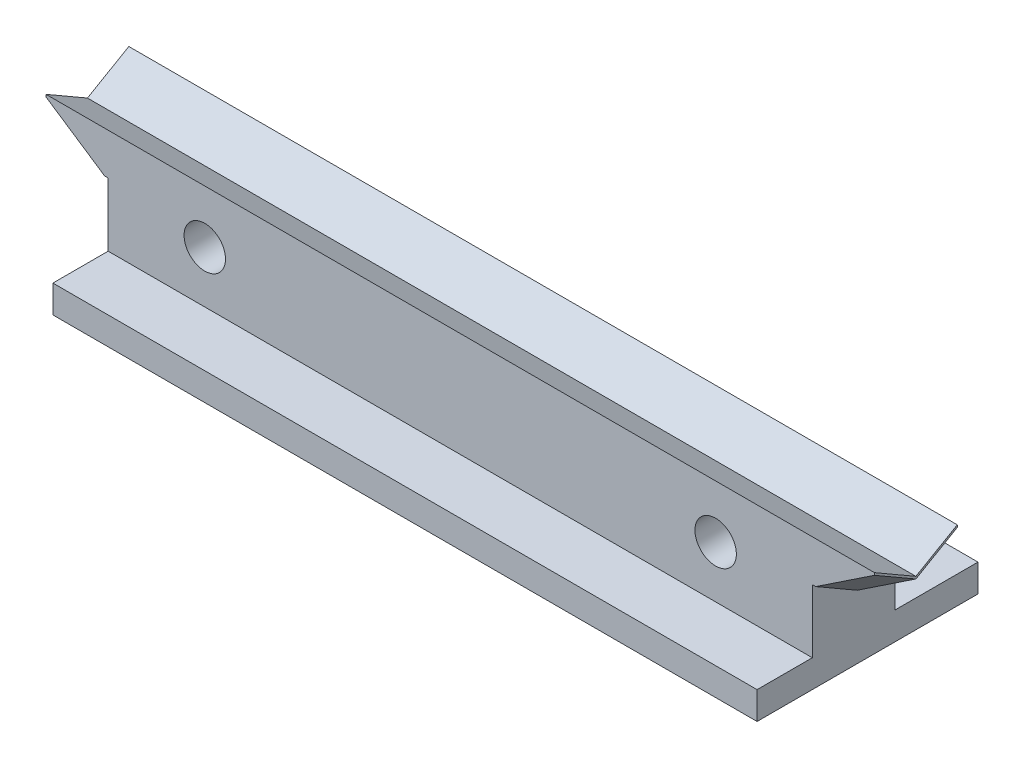
ISO-10303-21;
HEADER;
FILE_DESCRIPTION(('STEP AP214'),'2;1');
FILE_NAME('part.step','',(''),(''),'','','');
FILE_SCHEMA(('AUTOMOTIVE_DESIGN { 1 0 10303 214 1 1 1 1 }'));
ENDSEC;
DATA;
#1=APPLICATION_CONTEXT('core data for automotive mechanical design processes');
#2=APPLICATION_PROTOCOL_DEFINITION('international standard','automotive_design',2000,#1);
#3=PRODUCT_CONTEXT('',#1,'mechanical');
#4=PRODUCT('Part','Part','',(#3));
#5=PRODUCT_RELATED_PRODUCT_CATEGORY('part','',(#4));
#6=PRODUCT_DEFINITION_FORMATION('','',#4);
#7=PRODUCT_DEFINITION_CONTEXT('part definition',#1,'design');
#8=PRODUCT_DEFINITION('design','',#6,#7);
#9=PRODUCT_DEFINITION_SHAPE('','',#8);
#10=(LENGTH_UNIT() NAMED_UNIT(*) SI_UNIT(.MILLI.,.METRE.));
#11=(NAMED_UNIT(*) PLANE_ANGLE_UNIT() SI_UNIT($,.RADIAN.));
#12=(NAMED_UNIT(*) SI_UNIT($,.STERADIAN.) SOLID_ANGLE_UNIT());
#13=UNCERTAINTY_MEASURE_WITH_UNIT(LENGTH_MEASURE(1.E-05),#10,'distance_accuracy_value','');
#14=(GEOMETRIC_REPRESENTATION_CONTEXT(3) GLOBAL_UNCERTAINTY_ASSIGNED_CONTEXT((#13)) GLOBAL_UNIT_ASSIGNED_CONTEXT((#10,
#11,#12)) REPRESENTATION_CONTEXT('',''));
#15=CARTESIAN_POINT('',(0.,0.,0.));
#16=DIRECTION('',(0.,0.,1.));
#17=DIRECTION('',(1.,0.,0.));
#18=AXIS2_PLACEMENT_3D('',#15,#16,#17);
#19=CARTESIAN_POINT('',(-25.5,0.,0.));
#20=DIRECTION('',(1.,0.,0.));
#21=DIRECTION('',(0.,0.,-1.));
#22=AXIS2_PLACEMENT_3D('',#19,#20,#21);
#23=PLANE('',#22);
#24=DIRECTION('',(0.,0.5,0.866025403784439));
#25=VECTOR('',#24,1.);
#26=CARTESIAN_POINT('',(-25.5,-5.41228675972851,26.));
#27=LINE('',#26,#25);
#28=CARTESIAN_POINT('',(-25.5,-7.1443375672974,23.));
#29=VERTEX_POINT('',#28);
#30=CARTESIAN_POINT('',(-25.5,-5.41228675972851,26.));
#31=VERTEX_POINT('',#30);
#32=EDGE_CURVE('E162',#29,#31,#27,.T.);
#33=ORIENTED_EDGE('',*,*,#32,.F.);
#34=DIRECTION('',(0.,-0.500000000000003,0.866025403784437));
#35=VECTOR('',#34,1.);
#36=CARTESIAN_POINT('',(-25.5,-7.1443375672974,23.));
#37=LINE('',#36,#35);
#38=CARTESIAN_POINT('',(-25.5,-5.41228675972851,20.));
#39=VERTEX_POINT('',#38);
#40=EDGE_CURVE('E169',#39,#29,#37,.T.);
#41=ORIENTED_EDGE('',*,*,#40,.F.);
#42=DIRECTION('',(0.,-1.,0.));
#43=VECTOR('',#42,1.);
#44=CARTESIAN_POINT('',(-25.5,-2.41228675972852,20.));
#45=LINE('',#44,#43);
#46=CARTESIAN_POINT('',(-25.5,-9.99999999999999,20.));
#47=VERTEX_POINT('',#46);
#48=EDGE_CURVE('E185',#39,#47,#45,.T.);
#49=ORIENTED_EDGE('',*,*,#48,.T.);
#50=DIRECTION('',(0.,0.,-1.));
#51=VECTOR('',#50,1.);
#52=CARTESIAN_POINT('',(-25.5,-9.99999999999999,20.));
#53=LINE('',#52,#51);
#54=CARTESIAN_POINT('',(-25.5,-10.,14.));
#55=VERTEX_POINT('',#54);
#56=EDGE_CURVE('E373',#47,#55,#53,.T.);
#57=ORIENTED_EDGE('',*,*,#56,.T.);
#58=DIRECTION('',(0.,-1.,0.));
#59=VECTOR('',#58,1.);
#60=CARTESIAN_POINT('',(-25.5,-10.,14.));
#61=LINE('',#60,#59);
#62=CARTESIAN_POINT('',(-25.5,-12.,14.));
#63=VERTEX_POINT('',#62);
#64=EDGE_CURVE('E369',#55,#63,#61,.T.);
#65=ORIENTED_EDGE('',*,*,#64,.T.);
#66=DIRECTION('',(0.,0.,1.));
#67=VECTOR('',#66,1.);
#68=CARTESIAN_POINT('',(-25.5,-12.,30.));
#69=LINE('',#68,#67);
#70=CARTESIAN_POINT('',(-25.5,-12.,30.));
#71=VERTEX_POINT('',#70);
#72=EDGE_CURVE('E349',#63,#71,#69,.T.);
#73=ORIENTED_EDGE('',*,*,#72,.T.);
#74=DIRECTION('',(0.,1.,0.));
#75=VECTOR('',#74,1.);
#76=CARTESIAN_POINT('',(-25.5,-9.99999999999999,30.));
#77=LINE('',#76,#75);
#78=CARTESIAN_POINT('',(-25.5,-9.99999999999999,30.));
#79=VERTEX_POINT('',#78);
#80=EDGE_CURVE('E290',#71,#79,#77,.T.);
#81=ORIENTED_EDGE('',*,*,#80,.T.);
#82=DIRECTION('',(0.,0.,-1.));
#83=VECTOR('',#82,1.);
#84=CARTESIAN_POINT('',(-25.5,-9.99999999999999,30.));
#85=LINE('',#84,#83);
#86=CARTESIAN_POINT('',(-25.5,-9.99999999999999,26.));
#87=VERTEX_POINT('',#86);
#88=EDGE_CURVE('E293',#79,#87,#85,.T.);
#89=ORIENTED_EDGE('',*,*,#88,.T.);
#90=DIRECTION('',(0.,1.,0.));
#91=VECTOR('',#90,1.);
#92=CARTESIAN_POINT('',(-25.5,-2.41228675972851,26.));
#93=LINE('',#92,#91);
#94=EDGE_CURVE('E177',#87,#31,#93,.T.);
#95=ORIENTED_EDGE('',*,*,#94,.T.);
#96=EDGE_LOOP('',(#33,#41,#49,#57,#65,#73,#81,#89,#95));
#97=FACE_BOUND('',#96,.T.);
#98=ADVANCED_FACE('F32',(#97),#23,.F.);
#99=CARTESIAN_POINT('',(25.5,57.,-15.501));
#100=DIRECTION('',(-1.,0.,0.));
#101=DIRECTION('',(0.,-1.,0.));
#102=AXIS2_PLACEMENT_3D('',#99,#100,#101);
#103=PLANE('',#102);
#104=DIRECTION('',(0.,0.500000000000003,-0.866025403784437));
#105=VECTOR('',#104,1.);
#106=CARTESIAN_POINT('',(25.5,-7.1443375672974,23.));
#107=LINE('',#106,#105);
#108=CARTESIAN_POINT('',(25.5,-7.1443375672974,23.));
#109=VERTEX_POINT('',#108);
#110=CARTESIAN_POINT('',(25.5,-5.41228675972851,20.));
#111=VERTEX_POINT('',#110);
#112=EDGE_CURVE('E239',#109,#111,#107,.T.);
#113=ORIENTED_EDGE('',*,*,#112,.F.);
#114=DIRECTION('',(0.,-0.5,-0.866025403784439));
#115=VECTOR('',#114,1.);
#116=CARTESIAN_POINT('',(25.5,-5.41228675972851,26.));
#117=LINE('',#116,#115);
#118=CARTESIAN_POINT('',(25.5,-5.41228675972851,26.));
#119=VERTEX_POINT('',#118);
#120=EDGE_CURVE('E262',#119,#109,#117,.T.);
#121=ORIENTED_EDGE('',*,*,#120,.F.);
#122=DIRECTION('',(0.,-1.,0.));
#123=VECTOR('',#122,1.);
#124=CARTESIAN_POINT('',(25.5,-2.41228675972852,26.));
#125=LINE('',#124,#123);
#126=CARTESIAN_POINT('',(25.5,-10.,26.));
#127=VERTEX_POINT('',#126);
#128=EDGE_CURVE('E270',#119,#127,#125,.T.);
#129=ORIENTED_EDGE('',*,*,#128,.T.);
#130=DIRECTION('',(0.,0.,1.));
#131=VECTOR('',#130,1.);
#132=CARTESIAN_POINT('',(25.5,-10.,30.));
#133=LINE('',#132,#131);
#134=CARTESIAN_POINT('',(25.5,-10.,30.));
#135=VERTEX_POINT('',#134);
#136=EDGE_CURVE('E250',#127,#135,#133,.T.);
#137=ORIENTED_EDGE('',*,*,#136,.T.);
#138=DIRECTION('',(0.,-1.,0.));
#139=VECTOR('',#138,1.);
#140=CARTESIAN_POINT('',(25.5,-10.,30.));
#141=LINE('',#140,#139);
#142=CARTESIAN_POINT('',(25.5,-12.,30.));
#143=VERTEX_POINT('',#142);
#144=EDGE_CURVE('E288',#135,#143,#141,.T.);
#145=ORIENTED_EDGE('',*,*,#144,.T.);
#146=DIRECTION('',(0.,0.,-1.));
#147=VECTOR('',#146,1.);
#148=CARTESIAN_POINT('',(25.5,-12.,30.));
#149=LINE('',#148,#147);
#150=CARTESIAN_POINT('',(25.5,-12.,14.));
#151=VERTEX_POINT('',#150);
#152=EDGE_CURVE('E286',#143,#151,#149,.T.);
#153=ORIENTED_EDGE('',*,*,#152,.T.);
#154=DIRECTION('',(0.,1.,0.));
#155=VECTOR('',#154,1.);
#156=CARTESIAN_POINT('',(25.5,-10.,14.));
#157=LINE('',#156,#155);
#158=CARTESIAN_POINT('',(25.5,-10.,14.));
#159=VERTEX_POINT('',#158);
#160=EDGE_CURVE('E284',#151,#159,#157,.T.);
#161=ORIENTED_EDGE('',*,*,#160,.T.);
#162=DIRECTION('',(0.,0.,1.));
#163=VECTOR('',#162,1.);
#164=CARTESIAN_POINT('',(25.5,-10.,20.));
#165=LINE('',#164,#163);
#166=CARTESIAN_POINT('',(25.5,-10.,20.));
#167=VERTEX_POINT('',#166);
#168=EDGE_CURVE('E282',#159,#167,#165,.T.);
#169=ORIENTED_EDGE('',*,*,#168,.T.);
#170=DIRECTION('',(0.,1.,0.));
#171=VECTOR('',#170,1.);
#172=CARTESIAN_POINT('',(25.5,-2.41228675972853,20.));
#173=LINE('',#172,#171);
#174=EDGE_CURVE('E273',#167,#111,#173,.T.);
#175=ORIENTED_EDGE('',*,*,#174,.T.);
#176=EDGE_LOOP('',(#113,#121,#129,#137,#145,#153,#161,#169,#175));
#177=FACE_BOUND('',#176,.T.);
#178=ADVANCED_FACE('F354',(#177),#103,.F.);
#179=CARTESIAN_POINT('',(44.1527275533011,-10.,30.));
#180=DIRECTION('',(0.,0.,1.));
#181=DIRECTION('',(1.,0.,0.));
#182=AXIS2_PLACEMENT_3D('',#179,#180,#181);
#183=PLANE('',#182);
#184=ORIENTED_EDGE('',*,*,#144,.F.);
#185=DIRECTION('',(-1.,0.,0.));
#186=VECTOR('',#185,1.);
#187=CARTESIAN_POINT('',(44.1527275533011,-10.,30.));
#188=LINE('',#187,#186);
#189=EDGE_CURVE('E346',#135,#79,#188,.T.);
#190=ORIENTED_EDGE('',*,*,#189,.T.);
#191=ORIENTED_EDGE('',*,*,#80,.F.);
#192=DIRECTION('',(-1.,0.,0.));
#193=VECTOR('',#192,1.);
#194=CARTESIAN_POINT('',(44.1527275533011,-12.,30.));
#195=LINE('',#194,#193);
#196=EDGE_CURVE('E274',#143,#71,#195,.T.);
#197=ORIENTED_EDGE('',*,*,#196,.F.);
#198=EDGE_LOOP('',(#184,#190,#191,#197));
#199=FACE_BOUND('',#198,.T.);
#200=ADVANCED_FACE('F360',(#199),#183,.T.);
#201=CARTESIAN_POINT('',(44.1527275533011,-12.,30.));
#202=DIRECTION('',(0.,-1.,0.));
#203=DIRECTION('',(0.,0.,-1.));
#204=AXIS2_PLACEMENT_3D('',#201,#202,#203);
#205=PLANE('',#204);
#206=ORIENTED_EDGE('',*,*,#152,.F.);
#207=ORIENTED_EDGE('',*,*,#196,.T.);
#208=ORIENTED_EDGE('',*,*,#72,.F.);
#209=DIRECTION('',(-1.,0.,0.));
#210=VECTOR('',#209,1.);
#211=CARTESIAN_POINT('',(44.1527275533011,-12.,14.));
#212=LINE('',#211,#210);
#213=EDGE_CURVE('E377',#151,#63,#212,.T.);
#214=ORIENTED_EDGE('',*,*,#213,.F.);
#215=EDGE_LOOP('',(#206,#207,#208,#214));
#216=FACE_BOUND('',#215,.T.);
#217=ADVANCED_FACE('F393',(#216),#205,.T.);
#218=CARTESIAN_POINT('',(44.1527275533011,-10.,14.));
#219=DIRECTION('',(0.,0.,-1.));
#220=DIRECTION('',(-1.,0.,0.));
#221=AXIS2_PLACEMENT_3D('',#218,#219,#220);
#222=PLANE('',#221);
#223=ORIENTED_EDGE('',*,*,#160,.F.);
#224=ORIENTED_EDGE('',*,*,#213,.T.);
#225=ORIENTED_EDGE('',*,*,#64,.F.);
#226=DIRECTION('',(-1.,0.,0.));
#227=VECTOR('',#226,1.);
#228=CARTESIAN_POINT('',(44.1527275533011,-10.,14.));
#229=LINE('',#228,#227);
#230=EDGE_CURVE('E379',#159,#55,#229,.T.);
#231=ORIENTED_EDGE('',*,*,#230,.F.);
#232=EDGE_LOOP('',(#223,#224,#225,#231));
#233=FACE_BOUND('',#232,.T.);
#234=ADVANCED_FACE('F392',(#233),#222,.T.);
#235=CARTESIAN_POINT('',(44.1527275533011,-10.,20.));
#236=DIRECTION('',(0.,1.,0.));
#237=DIRECTION('',(0.,0.,1.));
#238=AXIS2_PLACEMENT_3D('',#235,#236,#237);
#239=PLANE('',#238);
#240=ORIENTED_EDGE('',*,*,#168,.F.);
#241=ORIENTED_EDGE('',*,*,#230,.T.);
#242=ORIENTED_EDGE('',*,*,#56,.F.);
#243=DIRECTION('',(-1.,0.,0.));
#244=VECTOR('',#243,1.);
#245=CARTESIAN_POINT('',(44.1527275533011,-10.,20.));
#246=LINE('',#245,#244);
#247=EDGE_CURVE('E334',#167,#47,#246,.T.);
#248=ORIENTED_EDGE('',*,*,#247,.F.);
#249=EDGE_LOOP('',(#240,#241,#242,#248));
#250=FACE_BOUND('',#249,.T.);
#251=ADVANCED_FACE('F388',(#250),#239,.T.);
#252=CARTESIAN_POINT('',(44.1527275533011,-2.41228675972852,20.));
#253=DIRECTION('',(0.,0.,-1.));
#254=DIRECTION('',(-1.,0.,0.));
#255=AXIS2_PLACEMENT_3D('',#252,#253,#254);
#256=PLANE('',#255);
#257=CARTESIAN_POINT('',(-18.5,-6.25,20.));
#258=DIRECTION('',(0.,0.,-1.));
#259=DIRECTION('',(-1.,0.,0.));
#260=AXIS2_PLACEMENT_3D('',#257,#258,#259);
#261=CIRCLE('',#260,1.5);
#262=CARTESIAN_POINT('',(-20.,-6.25,20.));
#263=VERTEX_POINT('',#262);
#264=EDGE_CURVE('E209',#263,#263,#261,.T.);
#265=ORIENTED_EDGE('',*,*,#264,.F.);
#266=EDGE_LOOP('',(#265));
#267=FACE_BOUND('',#266,.T.);
#268=CARTESIAN_POINT('',(18.5,-6.24999999999999,20.));
#269=DIRECTION('',(0.,0.,-1.));
#270=DIRECTION('',(-1.,0.,0.));
#271=AXIS2_PLACEMENT_3D('',#268,#269,#270);
#272=CIRCLE('',#271,1.5);
#273=CARTESIAN_POINT('',(17.,-6.24999999999999,20.));
#274=VERTEX_POINT('',#273);
#275=EDGE_CURVE('E212',#274,#274,#272,.T.);
#276=ORIENTED_EDGE('',*,*,#275,.F.);
#277=EDGE_LOOP('',(#276));
#278=FACE_BOUND('',#277,.T.);
#279=DIRECTION('',(1.,0.,0.));
#280=VECTOR('',#279,1.);
#281=CARTESIAN_POINT('',(-37.6414857747308,-5.41228675972851,20.));
#282=LINE('',#281,#280);
#283=CARTESIAN_POINT('',(-25.75,-5.41228675972852,20.));
#284=VERTEX_POINT('',#283);
#285=EDGE_CURVE('E168',#284,#39,#282,.T.);
#286=ORIENTED_EDGE('',*,*,#285,.F.);
#287=DIRECTION('',(0.832050294337844,-0.554700196225229,0.));
#288=VECTOR('',#287,1.);
#289=CARTESIAN_POINT('',(21.2595806138239,-36.7520071689444,20.));
#290=LINE('',#289,#288);
#291=CARTESIAN_POINT('',(-30.,-2.57895342639516,20.));
#292=VERTEX_POINT('',#291);
#293=EDGE_CURVE('E199',#284,#292,#290,.F.);
#294=ORIENTED_EDGE('',*,*,#293,.T.);
#295=DIRECTION('',(0.,1.,0.));
#296=VECTOR('',#295,1.);
#297=CARTESIAN_POINT('',(-30.,-2.41228675972852,20.));
#298=LINE('',#297,#296);
#299=CARTESIAN_POINT('',(-30.,-2.41228675972852,20.));
#300=VERTEX_POINT('',#299);
#301=EDGE_CURVE('E206',#292,#300,#298,.T.);
#302=ORIENTED_EDGE('',*,*,#301,.T.);
#303=DIRECTION('',(-1.,0.,0.));
#304=VECTOR('',#303,1.);
#305=CARTESIAN_POINT('',(44.1527275533011,-2.41228675972852,20.));
#306=LINE('',#305,#304);
#307=CARTESIAN_POINT('',(30.,-2.41228675972852,20.));
#308=VERTEX_POINT('',#307);
#309=EDGE_CURVE('E330',#308,#300,#306,.T.);
#310=ORIENTED_EDGE('',*,*,#309,.F.);
#311=DIRECTION('',(0.,1.,0.));
#312=VECTOR('',#311,1.);
#313=CARTESIAN_POINT('',(30.,-5.41228675972851,20.));
#314=LINE('',#313,#312);
#315=CARTESIAN_POINT('',(30.,-2.57895342639518,20.));
#316=VERTEX_POINT('',#315);
#317=EDGE_CURVE('E243',#316,#308,#314,.T.);
#318=ORIENTED_EDGE('',*,*,#317,.F.);
#319=DIRECTION('',(-0.832050294337845,-0.554700196225228,0.));
#320=VECTOR('',#319,1.);
#321=CARTESIAN_POINT('',(39.8749652292085,4.00435672641044,20.));
#322=LINE('',#321,#320);
#323=CARTESIAN_POINT('',(25.75,-5.41228675972851,20.));
#324=VERTEX_POINT('',#323);
#325=EDGE_CURVE('E253',#316,#324,#322,.T.);
#326=ORIENTED_EDGE('',*,*,#325,.T.);
#327=DIRECTION('',(-1.,0.,0.));
#328=VECTOR('',#327,1.);
#329=CARTESIAN_POINT('',(37.6414857747308,-5.41228675972851,20.));
#330=LINE('',#329,#328);
#331=EDGE_CURVE('E254',#324,#111,#330,.T.);
#332=ORIENTED_EDGE('',*,*,#331,.T.);
#333=ORIENTED_EDGE('',*,*,#174,.F.);
#334=ORIENTED_EDGE('',*,*,#247,.T.);
#335=ORIENTED_EDGE('',*,*,#48,.F.);
#336=EDGE_LOOP('',(#286,#294,#302,#310,#318,#326,#332,#333,#334,#335));
#337=FACE_BOUND('',#336,.T.);
#338=ADVANCED_FACE('F331',(#267,#278,#337),#256,.T.);
#339=CARTESIAN_POINT('',(44.1527275533011,-4.1443375672974,23.));
#340=DIRECTION('',(0.,0.866025403784438,0.500000000000001));
#341=DIRECTION('',(0.,-0.500000000000001,0.866025403784438));
#342=AXIS2_PLACEMENT_3D('',#339,#340,#341);
#343=PLANE('',#342);
#344=DIRECTION('',(-1.,0.,0.));
#345=VECTOR('',#344,1.);
#346=CARTESIAN_POINT('',(44.1527275533011,-4.1443375672974,23.));
#347=LINE('',#346,#345);
#348=CARTESIAN_POINT('',(30.,-4.1443375672974,23.));
#349=VERTEX_POINT('',#348);
#350=CARTESIAN_POINT('',(-30.,-4.1443375672974,23.));
#351=VERTEX_POINT('',#350);
#352=EDGE_CURVE('E335',#349,#351,#347,.T.);
#353=ORIENTED_EDGE('',*,*,#352,.F.);
#354=DIRECTION('',(0.,-0.500000000000002,0.866025403784438));
#355=VECTOR('',#354,1.);
#356=CARTESIAN_POINT('',(30.,-2.41228675972852,20.));
#357=LINE('',#356,#355);
#358=EDGE_CURVE('E324',#308,#349,#357,.T.);
#359=ORIENTED_EDGE('',*,*,#358,.F.);
#360=ORIENTED_EDGE('',*,*,#309,.T.);
#361=DIRECTION('',(0.,-0.500000000000003,0.866025403784437));
#362=VECTOR('',#361,1.);
#363=CARTESIAN_POINT('',(-30.,-2.41228675972852,20.));
#364=LINE('',#363,#362);
#365=EDGE_CURVE('E224',#300,#351,#364,.T.);
#366=ORIENTED_EDGE('',*,*,#365,.T.);
#367=EDGE_LOOP('',(#353,#359,#360,#366));
#368=FACE_BOUND('',#367,.T.);
#369=ADVANCED_FACE('F337',(#368),#343,.T.);
#370=CARTESIAN_POINT('',(44.1527275533011,-4.1443375672974,23.));
#371=DIRECTION('',(0.,0.86602540378444,-0.499999999999999));
#372=DIRECTION('',(0.,0.499999999999999,0.86602540378444));
#373=AXIS2_PLACEMENT_3D('',#370,#371,#372);
#374=PLANE('',#373);
#375=DIRECTION('',(-1.,0.,0.));
#376=VECTOR('',#375,1.);
#377=CARTESIAN_POINT('',(44.1527275533011,-2.41228675972852,26.));
#378=LINE('',#377,#376);
#379=CARTESIAN_POINT('',(30.,-2.41228675972851,26.));
#380=VERTEX_POINT('',#379);
#381=CARTESIAN_POINT('',(-30.,-2.41228675972851,26.));
#382=VERTEX_POINT('',#381);
#383=EDGE_CURVE('E340',#380,#382,#378,.T.);
#384=ORIENTED_EDGE('',*,*,#383,.F.);
#385=DIRECTION('',(0.,0.5,0.866025403784439));
#386=VECTOR('',#385,1.);
#387=CARTESIAN_POINT('',(30.,-4.1443375672974,23.));
#388=LINE('',#387,#386);
#389=EDGE_CURVE('E323',#349,#380,#388,.T.);
#390=ORIENTED_EDGE('',*,*,#389,.F.);
#391=ORIENTED_EDGE('',*,*,#352,.T.);
#392=DIRECTION('',(0.,0.5,0.866025403784439));
#393=VECTOR('',#392,1.);
#394=CARTESIAN_POINT('',(-30.,-4.1443375672974,23.));
#395=LINE('',#394,#393);
#396=EDGE_CURVE('E227',#351,#382,#395,.T.);
#397=ORIENTED_EDGE('',*,*,#396,.T.);
#398=EDGE_LOOP('',(#384,#390,#391,#397));
#399=FACE_BOUND('',#398,.T.);
#400=ADVANCED_FACE('F342',(#399),#374,.T.);
#401=CARTESIAN_POINT('',(44.1527275533011,-2.41228675972852,26.));
#402=DIRECTION('',(0.,0.,1.));
#403=DIRECTION('',(1.,0.,0.));
#404=AXIS2_PLACEMENT_3D('',#401,#402,#403);
#405=PLANE('',#404);
#406=CARTESIAN_POINT('',(-18.5,-6.25,26.));
#407=DIRECTION('',(0.,0.,1.));
#408=DIRECTION('',(1.,0.,0.));
#409=AXIS2_PLACEMENT_3D('',#406,#407,#408);
#410=CIRCLE('',#409,1.5);
#411=CARTESIAN_POINT('',(-17.,-6.25,26.));
#412=VERTEX_POINT('',#411);
#413=EDGE_CURVE('E36',#412,#412,#410,.T.);
#414=ORIENTED_EDGE('',*,*,#413,.F.);
#415=EDGE_LOOP('',(#414));
#416=FACE_BOUND('',#415,.T.);
#417=CARTESIAN_POINT('',(18.5,-6.24999999999999,26.));
#418=DIRECTION('',(0.,0.,1.));
#419=DIRECTION('',(1.,0.,0.));
#420=AXIS2_PLACEMENT_3D('',#417,#418,#419);
#421=CIRCLE('',#420,1.5);
#422=CARTESIAN_POINT('',(20.,-6.24999999999999,26.));
#423=VERTEX_POINT('',#422);
#424=EDGE_CURVE('E210',#423,#423,#421,.T.);
#425=ORIENTED_EDGE('',*,*,#424,.F.);
#426=EDGE_LOOP('',(#425));
#427=FACE_BOUND('',#426,.T.);
#428=DIRECTION('',(0.,-1.,0.));
#429=VECTOR('',#428,1.);
#430=CARTESIAN_POINT('',(-30.,-5.41228675972851,26.));
#431=LINE('',#430,#429);
#432=CARTESIAN_POINT('',(-30.,-2.57895342639515,26.));
#433=VERTEX_POINT('',#432);
#434=EDGE_CURVE('E230',#382,#433,#431,.T.);
#435=ORIENTED_EDGE('',*,*,#434,.T.);
#436=DIRECTION('',(-0.832050294337845,0.554700196225227,0.));
#437=VECTOR('',#436,1.);
#438=CARTESIAN_POINT('',(21.2595806138241,-36.7520071689443,26.));
#439=LINE('',#438,#437);
#440=CARTESIAN_POINT('',(-25.75,-5.4122867597285,26.));
#441=VERTEX_POINT('',#440);
#442=EDGE_CURVE('E11',#433,#441,#439,.F.);
#443=ORIENTED_EDGE('',*,*,#442,.T.);
#444=DIRECTION('',(1.,0.,0.));
#445=VECTOR('',#444,1.);
#446=CARTESIAN_POINT('',(-37.6414857747308,-5.41228675972851,26.));
#447=LINE('',#446,#445);
#448=EDGE_CURVE('E195',#441,#31,#447,.T.);
#449=ORIENTED_EDGE('',*,*,#448,.T.);
#450=ORIENTED_EDGE('',*,*,#94,.F.);
#451=DIRECTION('',(-1.,0.,0.));
#452=VECTOR('',#451,1.);
#453=CARTESIAN_POINT('',(44.1527275533011,-10.,26.));
#454=LINE('',#453,#452);
#455=EDGE_CURVE('E344',#127,#87,#454,.T.);
#456=ORIENTED_EDGE('',*,*,#455,.F.);
#457=ORIENTED_EDGE('',*,*,#128,.F.);
#458=DIRECTION('',(-1.,0.,0.));
#459=VECTOR('',#458,1.);
#460=CARTESIAN_POINT('',(37.6414857747308,-5.41228675972851,26.));
#461=LINE('',#460,#459);
#462=CARTESIAN_POINT('',(25.75,-5.41228675972851,26.));
#463=VERTEX_POINT('',#462);
#464=EDGE_CURVE('E256',#463,#119,#461,.T.);
#465=ORIENTED_EDGE('',*,*,#464,.F.);
#466=DIRECTION('',(0.832050294337845,0.554700196225227,0.));
#467=VECTOR('',#466,1.);
#468=CARTESIAN_POINT('',(39.8749652292085,4.00435672641043,26.));
#469=LINE('',#468,#467);
#470=CARTESIAN_POINT('',(30.,-2.57895342639518,26.));
#471=VERTEX_POINT('',#470);
#472=EDGE_CURVE('E200',#463,#471,#469,.T.);
#473=ORIENTED_EDGE('',*,*,#472,.T.);
#474=DIRECTION('',(0.,-1.,0.));
#475=VECTOR('',#474,1.);
#476=CARTESIAN_POINT('',(30.,-2.41228675972851,26.));
#477=LINE('',#476,#475);
#478=EDGE_CURVE('E236',#380,#471,#477,.T.);
#479=ORIENTED_EDGE('',*,*,#478,.F.);
#480=ORIENTED_EDGE('',*,*,#383,.T.);
#481=EDGE_LOOP('',(#435,#443,#449,#450,#456,#457,#465,#473,#479,#480));
#482=FACE_BOUND('',#481,.T.);
#483=ADVANCED_FACE('F312',(#416,#427,#482),#405,.T.);
#484=CARTESIAN_POINT('',(44.1527275533011,-10.,30.));
#485=DIRECTION('',(0.,1.,0.));
#486=DIRECTION('',(0.,0.,1.));
#487=AXIS2_PLACEMENT_3D('',#484,#485,#486);
#488=PLANE('',#487);
#489=ORIENTED_EDGE('',*,*,#136,.F.);
#490=ORIENTED_EDGE('',*,*,#455,.T.);
#491=ORIENTED_EDGE('',*,*,#88,.F.);
#492=ORIENTED_EDGE('',*,*,#189,.F.);
#493=EDGE_LOOP('',(#489,#490,#491,#492));
#494=FACE_BOUND('',#493,.T.);
#495=ADVANCED_FACE('F363',(#494),#488,.T.);
#496=CARTESIAN_POINT('',(37.6414857747308,-5.41228675972851,26.));
#497=DIRECTION('',(0.,0.866025403784439,-0.5));
#498=DIRECTION('',(0.,0.5,0.866025403784439));
#499=AXIS2_PLACEMENT_3D('',#496,#497,#498);
#500=PLANE('',#499);
#501=DIRECTION('',(-1.,0.,0.));
#502=VECTOR('',#501,1.);
#503=CARTESIAN_POINT('',(37.6414857747308,-7.14433756729739,23.));
#504=LINE('',#503,#502);
#505=CARTESIAN_POINT('',(25.75,-7.1443375672974,23.));
#506=VERTEX_POINT('',#505);
#507=EDGE_CURVE('E244',#506,#109,#504,.T.);
#508=ORIENTED_EDGE('',*,*,#507,.F.);
#509=DIRECTION('',(0.,0.5,0.866025403784439));
#510=VECTOR('',#509,1.);
#511=CARTESIAN_POINT('',(25.75,-5.41228675972851,26.));
#512=LINE('',#511,#510);
#513=EDGE_CURVE('E260',#506,#463,#512,.T.);
#514=ORIENTED_EDGE('',*,*,#513,.T.);
#515=ORIENTED_EDGE('',*,*,#464,.T.);
#516=ORIENTED_EDGE('',*,*,#120,.T.);
#517=EDGE_LOOP('',(#508,#514,#515,#516));
#518=FACE_BOUND('',#517,.T.);
#519=ADVANCED_FACE('F307',(#518),#500,.F.);
#520=CARTESIAN_POINT('',(37.6414857747308,-7.14433756729739,23.));
#521=DIRECTION('',(0.,0.866025403784437,0.500000000000003));
#522=DIRECTION('',(0.,-0.500000000000003,0.866025403784437));
#523=AXIS2_PLACEMENT_3D('',#520,#521,#522);
#524=PLANE('',#523);
#525=ORIENTED_EDGE('',*,*,#331,.F.);
#526=DIRECTION('',(0.,-0.500000000000003,0.866025403784437));
#527=VECTOR('',#526,1.);
#528=CARTESIAN_POINT('',(25.75,-7.1443375672974,23.));
#529=LINE('',#528,#527);
#530=EDGE_CURVE('E258',#324,#506,#529,.T.);
#531=ORIENTED_EDGE('',*,*,#530,.T.);
#532=ORIENTED_EDGE('',*,*,#507,.T.);
#533=ORIENTED_EDGE('',*,*,#112,.T.);
#534=EDGE_LOOP('',(#525,#531,#532,#533));
#535=FACE_BOUND('',#534,.T.);
#536=ADVANCED_FACE('F396',(#535),#524,.F.);
#537=CARTESIAN_POINT('',(30.,0.,0.));
#538=DIRECTION('',(1.,0.,0.));
#539=DIRECTION('',(0.,0.,-1.));
#540=AXIS2_PLACEMENT_3D('',#537,#538,#539);
#541=PLANE('',#540);
#542=DIRECTION('',(0.,-0.5,-0.866025403784439));
#543=VECTOR('',#542,1.);
#544=CARTESIAN_POINT('',(30.,-5.0193375672974,21.773130677972));
#545=LINE('',#544,#543);
#546=CARTESIAN_POINT('',(30.,-4.31100423396406,23.));
#547=VERTEX_POINT('',#546);
#548=EDGE_CURVE('E247',#471,#547,#545,.T.);
#549=ORIENTED_EDGE('',*,*,#548,.T.);
#550=DIRECTION('',(0.,0.500000000000003,-0.866025403784437));
#551=VECTOR('',#550,1.);
#552=CARTESIAN_POINT('',(30.,-3.28728675972852,21.226869322028));
#553=LINE('',#552,#551);
#554=EDGE_CURVE('E249',#547,#316,#553,.T.);
#555=ORIENTED_EDGE('',*,*,#554,.T.);
#556=ORIENTED_EDGE('',*,*,#317,.T.);
#557=ORIENTED_EDGE('',*,*,#358,.T.);
#558=ORIENTED_EDGE('',*,*,#389,.T.);
#559=ORIENTED_EDGE('',*,*,#478,.T.);
#560=EDGE_LOOP('',(#549,#555,#556,#557,#558,#559));
#561=FACE_BOUND('',#560,.T.);
#562=ADVANCED_FACE('F318',(#561),#541,.T.);
#563=CARTESIAN_POINT('',(30.,-13.1925453189941,7.61671959121756));
#564=DIRECTION('',(0.499999999999998,-0.750000000000001,0.43301270189222));
#565=DIRECTION('',(0.,0.5,0.866025403784439));
#566=AXIS2_PLACEMENT_3D('',#563,#564,#565);
#567=PLANE('',#566);
#568=ORIENTED_EDGE('',*,*,#472,.F.);
#569=ORIENTED_EDGE('',*,*,#513,.F.);
#570=DIRECTION('',(0.832050294337845,0.554700196225227,0.));
#571=VECTOR('',#570,1.);
#572=CARTESIAN_POINT('',(25.9008271915246,-7.04378610628098,23.));
#573=LINE('',#572,#571);
#574=EDGE_CURVE('E231',#547,#506,#573,.F.);
#575=ORIENTED_EDGE('',*,*,#574,.F.);
#576=ORIENTED_EDGE('',*,*,#548,.F.);
#577=EDGE_LOOP('',(#568,#569,#575,#576));
#578=FACE_BOUND('',#577,.T.);
#579=ADVANCED_FACE('F315',(#578),#567,.T.);
#580=CARTESIAN_POINT('',(30.,6.72603896804805,3.88328040878249));
#581=DIRECTION('',(0.499999999999998,-0.75,-0.433012701892223));
#582=DIRECTION('',(0.,-0.500000000000003,0.866025403784437));
#583=AXIS2_PLACEMENT_3D('',#580,#581,#582);
#584=PLANE('',#583);
#585=ORIENTED_EDGE('',*,*,#574,.T.);
#586=ORIENTED_EDGE('',*,*,#530,.F.);
#587=ORIENTED_EDGE('',*,*,#325,.F.);
#588=ORIENTED_EDGE('',*,*,#554,.F.);
#589=EDGE_LOOP('',(#585,#586,#587,#588));
#590=FACE_BOUND('',#589,.T.);
#591=ADVANCED_FACE('F399',(#590),#584,.T.);
#592=CARTESIAN_POINT('',(-37.6414857747308,-7.1443375672974,23.));
#593=DIRECTION('',(0.,0.866025403784437,0.500000000000003));
#594=DIRECTION('',(0.,-0.500000000000003,0.866025403784437));
#595=AXIS2_PLACEMENT_3D('',#592,#593,#594);
#596=PLANE('',#595);
#597=DIRECTION('',(1.,0.,0.));
#598=VECTOR('',#597,1.);
#599=CARTESIAN_POINT('',(-37.6414857747308,-7.1443375672974,23.));
#600=LINE('',#599,#598);
#601=CARTESIAN_POINT('',(-25.75,-7.1443375672974,23.));
#602=VERTEX_POINT('',#601);
#603=EDGE_CURVE('E159',#602,#29,#600,.T.);
#604=ORIENTED_EDGE('',*,*,#603,.F.);
#605=DIRECTION('',(0.,0.500000000000003,-0.866025403784437));
#606=VECTOR('',#605,1.);
#607=CARTESIAN_POINT('',(-25.75,-7.1443375672974,23.));
#608=LINE('',#607,#606);
#609=EDGE_CURVE('E197',#602,#284,#608,.T.);
#610=ORIENTED_EDGE('',*,*,#609,.T.);
#611=ORIENTED_EDGE('',*,*,#285,.T.);
#612=ORIENTED_EDGE('',*,*,#40,.T.);
#613=EDGE_LOOP('',(#604,#610,#611,#612));
#614=FACE_BOUND('',#613,.T.);
#615=ADVANCED_FACE('F180',(#614),#596,.F.);
#616=CARTESIAN_POINT('',(-37.6414857747308,-5.41228675972851,26.));
#617=DIRECTION('',(0.,0.866025403784439,-0.5));
#618=DIRECTION('',(0.,0.5,0.866025403784439));
#619=AXIS2_PLACEMENT_3D('',#616,#617,#618);
#620=PLANE('',#619);
#621=ORIENTED_EDGE('',*,*,#448,.F.);
#622=DIRECTION('',(0.,-0.5,-0.866025403784439));
#623=VECTOR('',#622,1.);
#624=CARTESIAN_POINT('',(-25.75,-5.41228675972851,26.));
#625=LINE('',#624,#623);
#626=EDGE_CURVE('E41',#441,#602,#625,.T.);
#627=ORIENTED_EDGE('',*,*,#626,.T.);
#628=ORIENTED_EDGE('',*,*,#603,.T.);
#629=ORIENTED_EDGE('',*,*,#32,.T.);
#630=EDGE_LOOP('',(#621,#627,#628,#629));
#631=FACE_BOUND('',#630,.T.);
#632=ADVANCED_FACE('F161',(#631),#620,.F.);
#633=CARTESIAN_POINT('',(-30.,0.,0.));
#634=DIRECTION('',(1.,0.,0.));
#635=DIRECTION('',(0.,0.,-1.));
#636=AXIS2_PLACEMENT_3D('',#633,#634,#635);
#637=PLANE('',#636);
#638=ORIENTED_EDGE('',*,*,#301,.F.);
#639=DIRECTION('',(0.,-0.500000000000003,0.866025403784437));
#640=VECTOR('',#639,1.);
#641=CARTESIAN_POINT('',(-30.,6.72603896804806,3.88328040878249));
#642=LINE('',#641,#640);
#643=CARTESIAN_POINT('',(-30.,-4.31100423396405,23.));
#644=VERTEX_POINT('',#643);
#645=EDGE_CURVE('E55',#292,#644,#642,.T.);
#646=ORIENTED_EDGE('',*,*,#645,.T.);
#647=DIRECTION('',(0.,0.5,0.866025403784439));
#648=VECTOR('',#647,1.);
#649=CARTESIAN_POINT('',(-30.,-13.1925453189941,7.61671959121756));
#650=LINE('',#649,#648);
#651=EDGE_CURVE('E202',#644,#433,#650,.T.);
#652=ORIENTED_EDGE('',*,*,#651,.T.);
#653=ORIENTED_EDGE('',*,*,#434,.F.);
#654=ORIENTED_EDGE('',*,*,#396,.F.);
#655=ORIENTED_EDGE('',*,*,#365,.F.);
#656=EDGE_LOOP('',(#638,#646,#652,#653,#654,#655));
#657=FACE_BOUND('',#656,.T.);
#658=ADVANCED_FACE('F529',(#657),#637,.F.);
#659=CARTESIAN_POINT('',(-25.75,-5.41228675972851,26.));
#660=DIRECTION('',(0.499999999999998,0.750000000000001,-0.43301270189222));
#661=DIRECTION('',(0.,-0.5,-0.866025403784439));
#662=AXIS2_PLACEMENT_3D('',#659,#660,#661);
#663=PLANE('',#662);
#664=ORIENTED_EDGE('',*,*,#442,.F.);
#665=ORIENTED_EDGE('',*,*,#651,.F.);
#666=DIRECTION('',(0.832050294337845,-0.554700196225228,0.));
#667=VECTOR('',#666,1.);
#668=CARTESIAN_POINT('',(-26.5494080650318,-6.6113988572762,23.));
#669=LINE('',#668,#667);
#670=EDGE_CURVE('E178',#602,#644,#669,.F.);
#671=ORIENTED_EDGE('',*,*,#670,.F.);
#672=ORIENTED_EDGE('',*,*,#626,.F.);
#673=EDGE_LOOP('',(#664,#665,#671,#672));
#674=FACE_BOUND('',#673,.T.);
#675=ADVANCED_FACE('F34',(#674),#663,.F.);
#676=CARTESIAN_POINT('',(-25.75,-7.1443375672974,23.));
#677=DIRECTION('',(0.499999999999999,0.749999999999999,0.433012701892222));
#678=DIRECTION('',(0.,0.500000000000003,-0.866025403784437));
#679=AXIS2_PLACEMENT_3D('',#676,#677,#678);
#680=PLANE('',#679);
#681=ORIENTED_EDGE('',*,*,#670,.T.);
#682=ORIENTED_EDGE('',*,*,#645,.F.);
#683=ORIENTED_EDGE('',*,*,#293,.F.);
#684=ORIENTED_EDGE('',*,*,#609,.F.);
#685=EDGE_LOOP('',(#681,#682,#683,#684));
#686=FACE_BOUND('',#685,.T.);
#687=ADVANCED_FACE('F546',(#686),#680,.F.);
#688=CARTESIAN_POINT('',(18.5,-6.24999999999999,-30.));
#689=DIRECTION('',(0.,0.,1.));
#690=DIRECTION('',(1.,0.,0.));
#691=AXIS2_PLACEMENT_3D('',#688,#689,#690);
#692=CYLINDRICAL_SURFACE('',#691,1.5);
#693=ORIENTED_EDGE('',*,*,#275,.T.);
#694=EDGE_LOOP('',(#693));
#695=FACE_BOUND('',#694,.T.);
#696=ORIENTED_EDGE('',*,*,#424,.T.);
#697=EDGE_LOOP('',(#696));
#698=FACE_BOUND('',#697,.T.);
#699=ADVANCED_FACE('F555',(#695,#698),#692,.F.);
#700=CARTESIAN_POINT('',(-18.5,-6.25,-30.));
#701=DIRECTION('',(0.,0.,1.));
#702=DIRECTION('',(1.,0.,0.));
#703=AXIS2_PLACEMENT_3D('',#700,#701,#702);
#704=CYLINDRICAL_SURFACE('',#703,1.5);
#705=ORIENTED_EDGE('',*,*,#264,.T.);
#706=EDGE_LOOP('',(#705));
#707=FACE_BOUND('',#706,.T.);
#708=ORIENTED_EDGE('',*,*,#413,.T.);
#709=EDGE_LOOP('',(#708));
#710=FACE_BOUND('',#709,.T.);
#711=ADVANCED_FACE('F564',(#707,#710),#704,.F.);
#712=CLOSED_SHELL('',(#98,#178,#200,#217,#234,#251,#338,#369,#400,#483,#495,#519,#536,#562,#579,
#591,#615,#632,#658,#675,#687,#699,#711));
#713=MANIFOLD_SOLID_BREP('B2',#712);
#714=ADVANCED_BREP_SHAPE_REPRESENTATION('',(#18,#713),#14);
#715=SHAPE_DEFINITION_REPRESENTATION(#9,#714);
ENDSEC;
END-ISO-10303-21;
